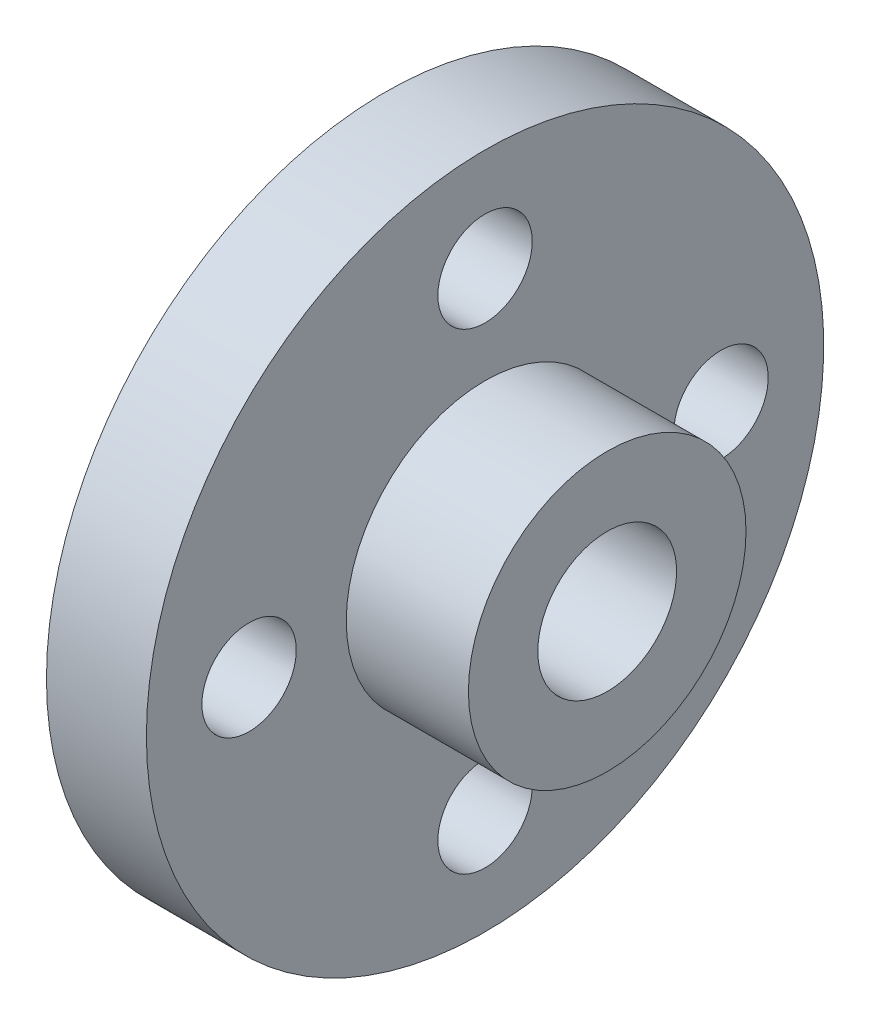
ISO-10303-21;
HEADER;
FILE_DESCRIPTION(('STEP AP214'),'2;1');
FILE_NAME('part.step','',(''),(''),'','','');
FILE_SCHEMA(('AUTOMOTIVE_DESIGN { 1 0 10303 214 1 1 1 1 }'));
ENDSEC;
DATA;
#1=APPLICATION_CONTEXT('core data for automotive mechanical design processes');
#2=APPLICATION_PROTOCOL_DEFINITION('international standard','automotive_design',2000,#1);
#3=PRODUCT_CONTEXT('',#1,'mechanical');
#4=PRODUCT('Part','Part','',(#3));
#5=PRODUCT_RELATED_PRODUCT_CATEGORY('part','',(#4));
#6=PRODUCT_DEFINITION_FORMATION('','',#4);
#7=PRODUCT_DEFINITION_CONTEXT('part definition',#1,'design');
#8=PRODUCT_DEFINITION('design','',#6,#7);
#9=PRODUCT_DEFINITION_SHAPE('','',#8);
#10=(LENGTH_UNIT() NAMED_UNIT(*) SI_UNIT(.MILLI.,.METRE.));
#11=(NAMED_UNIT(*) PLANE_ANGLE_UNIT() SI_UNIT($,.RADIAN.));
#12=(NAMED_UNIT(*) SI_UNIT($,.STERADIAN.) SOLID_ANGLE_UNIT());
#13=UNCERTAINTY_MEASURE_WITH_UNIT(LENGTH_MEASURE(1.E-05),#10,'distance_accuracy_value','');
#14=(GEOMETRIC_REPRESENTATION_CONTEXT(3) GLOBAL_UNCERTAINTY_ASSIGNED_CONTEXT((#13)) GLOBAL_UNIT_ASSIGNED_CONTEXT((#10,
#11,#12)) REPRESENTATION_CONTEXT('',''));
#15=CARTESIAN_POINT('',(0.,0.,0.));
#16=DIRECTION('',(0.,0.,1.));
#17=DIRECTION('',(1.,0.,0.));
#18=AXIS2_PLACEMENT_3D('',#15,#16,#17);
#19=CARTESIAN_POINT('',(-16.9594650205761,0.,0.));
#20=DIRECTION('',(-1.,0.,0.));
#21=DIRECTION('',(0.,0.,1.));
#22=AXIS2_PLACEMENT_3D('',#19,#20,#21);
#23=CYLINDRICAL_SURFACE('',#22,25.);
#24=CARTESIAN_POINT('',(0.,0.,0.));
#25=DIRECTION('',(-1.,0.,0.));
#26=DIRECTION('',(0.,0.,1.));
#27=AXIS2_PLACEMENT_3D('',#24,#25,#26);
#28=CIRCLE('',#27,25.);
#29=CARTESIAN_POINT('',(0.,0.,25.));
#30=VERTEX_POINT('',#29);
#31=EDGE_CURVE('E17',#30,#30,#28,.F.);
#32=ORIENTED_EDGE('',*,*,#31,.T.);
#33=EDGE_LOOP('',(#32));
#34=FACE_BOUND('',#33,.T.);
#35=CARTESIAN_POINT('',(22.,0.,0.));
#36=DIRECTION('',(-1.,0.,0.));
#37=DIRECTION('',(0.,0.,1.));
#38=AXIS2_PLACEMENT_3D('',#35,#36,#37);
#39=CIRCLE('',#38,25.);
#40=CARTESIAN_POINT('',(22.,0.,25.));
#41=VERTEX_POINT('',#40);
#42=EDGE_CURVE('E57',#41,#41,#39,.T.);
#43=ORIENTED_EDGE('',*,*,#42,.T.);
#44=EDGE_LOOP('',(#43));
#45=FACE_BOUND('',#44,.T.);
#46=ADVANCED_FACE('F14',(#34,#45),#23,.T.);
#47=CARTESIAN_POINT('',(0.,61.,0.));
#48=DIRECTION('',(-1.,0.,0.));
#49=DIRECTION('',(0.,0.,1.));
#50=AXIS2_PLACEMENT_3D('',#47,#48,#49);
#51=PLANE('',#50);
#52=CARTESIAN_POINT('',(0.,4.451638707025E-13,-42.5));
#53=DIRECTION('',(-1.,0.,0.));
#54=DIRECTION('',(0.,0.,1.));
#55=AXIS2_PLACEMENT_3D('',#52,#53,#54);
#56=CIRCLE('',#55,8.5);
#57=CARTESIAN_POINT('',(0.,4.451638707025E-13,-34.));
#58=VERTEX_POINT('',#57);
#59=EDGE_CURVE('E55',#58,#58,#56,.T.);
#60=ORIENTED_EDGE('',*,*,#59,.T.);
#61=EDGE_LOOP('',(#60));
#62=FACE_BOUND('',#61,.T.);
#63=CARTESIAN_POINT('',(0.,-1.48387956900833E-13,42.5));
#64=DIRECTION('',(-1.,0.,0.));
#65=DIRECTION('',(0.,0.,1.));
#66=AXIS2_PLACEMENT_3D('',#63,#64,#65);
#67=CIRCLE('',#66,8.5);
#68=CARTESIAN_POINT('',(0.,-1.48387956900833E-13,51.));
#69=VERTEX_POINT('',#68);
#70=EDGE_CURVE('E52',#69,#69,#67,.T.);
#71=ORIENTED_EDGE('',*,*,#70,.T.);
#72=EDGE_LOOP('',(#71));
#73=FACE_BOUND('',#72,.T.);
#74=ORIENTED_EDGE('',*,*,#31,.F.);
#75=EDGE_LOOP('',(#74));
#76=FACE_BOUND('',#75,.T.);
#77=CARTESIAN_POINT('',(0.,0.,0.));
#78=DIRECTION('',(-1.,0.,0.));
#79=DIRECTION('',(0.,0.,1.));
#80=AXIS2_PLACEMENT_3D('',#77,#78,#79);
#81=CIRCLE('',#80,61.);
#82=CARTESIAN_POINT('',(0.,0.,61.));
#83=VERTEX_POINT('',#82);
#84=EDGE_CURVE('E49',#83,#83,#81,.T.);
#85=ORIENTED_EDGE('',*,*,#84,.F.);
#86=EDGE_LOOP('',(#85));
#87=FACE_BOUND('',#86,.T.);
#88=CARTESIAN_POINT('',(0.,42.5,0.));
#89=DIRECTION('',(-1.,0.,0.));
#90=DIRECTION('',(0.,0.,1.));
#91=AXIS2_PLACEMENT_3D('',#88,#89,#90);
#92=CIRCLE('',#91,8.5);
#93=CARTESIAN_POINT('',(0.,42.5,8.5));
#94=VERTEX_POINT('',#93);
#95=EDGE_CURVE('E46',#94,#94,#92,.T.);
#96=ORIENTED_EDGE('',*,*,#95,.T.);
#97=EDGE_LOOP('',(#96));
#98=FACE_BOUND('',#97,.T.);
#99=CARTESIAN_POINT('',(0.,-42.5,-2.96775913801666E-13));
#100=DIRECTION('',(-1.,0.,0.));
#101=DIRECTION('',(0.,0.,1.));
#102=AXIS2_PLACEMENT_3D('',#99,#100,#101);
#103=CIRCLE('',#102,8.5);
#104=CARTESIAN_POINT('',(0.,-42.5,8.4999999999997));
#105=VERTEX_POINT('',#104);
#106=EDGE_CURVE('E43',#105,#105,#103,.T.);
#107=ORIENTED_EDGE('',*,*,#106,.T.);
#108=EDGE_LOOP('',(#107));
#109=FACE_BOUND('',#108,.T.);
#110=ADVANCED_FACE('F65',(#62,#73,#76,#87,#98,#109),#51,.F.);
#111=CARTESIAN_POINT('',(22.,25.,0.));
#112=DIRECTION('',(-1.,0.,0.));
#113=DIRECTION('',(0.,0.,1.));
#114=AXIS2_PLACEMENT_3D('',#111,#112,#113);
#115=PLANE('',#114);
#116=CARTESIAN_POINT('',(22.,0.,0.));
#117=DIRECTION('',(-1.,0.,0.));
#118=DIRECTION('',(0.,0.,1.));
#119=AXIS2_PLACEMENT_3D('',#116,#117,#118);
#120=CIRCLE('',#119,12.5);
#121=CARTESIAN_POINT('',(22.,0.,12.5));
#122=VERTEX_POINT('',#121);
#123=EDGE_CURVE('E40',#122,#122,#120,.T.);
#124=ORIENTED_EDGE('',*,*,#123,.T.);
#125=EDGE_LOOP('',(#124));
#126=FACE_BOUND('',#125,.T.);
#127=ORIENTED_EDGE('',*,*,#42,.F.);
#128=EDGE_LOOP('',(#127));
#129=FACE_BOUND('',#128,.T.);
#130=ADVANCED_FACE('F68',(#126,#129),#115,.F.);
#131=CARTESIAN_POINT('',(22.,4.451638707025E-13,-42.5));
#132=DIRECTION('',(-1.,0.,0.));
#133=DIRECTION('',(0.,0.,1.));
#134=AXIS2_PLACEMENT_3D('',#131,#132,#133);
#135=CYLINDRICAL_SURFACE('',#134,8.5);
#136=CARTESIAN_POINT('',(-18.,4.451638707025E-13,-42.5));
#137=DIRECTION('',(-1.,0.,0.));
#138=DIRECTION('',(0.,0.,1.));
#139=AXIS2_PLACEMENT_3D('',#136,#137,#138);
#140=CIRCLE('',#139,8.5);
#141=CARTESIAN_POINT('',(-18.,4.451638707025E-13,-34.));
#142=VERTEX_POINT('',#141);
#143=EDGE_CURVE('E37',#142,#142,#140,.T.);
#144=ORIENTED_EDGE('',*,*,#143,.T.);
#145=EDGE_LOOP('',(#144));
#146=FACE_BOUND('',#145,.T.);
#147=ORIENTED_EDGE('',*,*,#59,.F.);
#148=EDGE_LOOP('',(#147));
#149=FACE_BOUND('',#148,.T.);
#150=ADVANCED_FACE('F109',(#146,#149),#135,.F.);
#151=CARTESIAN_POINT('',(22.,-1.48387956900833E-13,42.5));
#152=DIRECTION('',(-1.,0.,0.));
#153=DIRECTION('',(0.,0.,1.));
#154=AXIS2_PLACEMENT_3D('',#151,#152,#153);
#155=CYLINDRICAL_SURFACE('',#154,8.5);
#156=CARTESIAN_POINT('',(-18.,-1.48387956900833E-13,42.5));
#157=DIRECTION('',(-1.,0.,0.));
#158=DIRECTION('',(0.,0.,1.));
#159=AXIS2_PLACEMENT_3D('',#156,#157,#158);
#160=CIRCLE('',#159,8.5);
#161=CARTESIAN_POINT('',(-18.,-1.48387956900833E-13,51.));
#162=VERTEX_POINT('',#161);
#163=EDGE_CURVE('E34',#162,#162,#160,.T.);
#164=ORIENTED_EDGE('',*,*,#163,.T.);
#165=EDGE_LOOP('',(#164));
#166=FACE_BOUND('',#165,.T.);
#167=ORIENTED_EDGE('',*,*,#70,.F.);
#168=EDGE_LOOP('',(#167));
#169=FACE_BOUND('',#168,.T.);
#170=ADVANCED_FACE('F112',(#166,#169),#155,.F.);
#171=CARTESIAN_POINT('',(-16.9594650205761,0.,0.));
#172=DIRECTION('',(-1.,0.,0.));
#173=DIRECTION('',(0.,0.,1.));
#174=AXIS2_PLACEMENT_3D('',#171,#172,#173);
#175=CYLINDRICAL_SURFACE('',#174,61.);
#176=CARTESIAN_POINT('',(-18.,0.,0.));
#177=DIRECTION('',(-1.,0.,0.));
#178=DIRECTION('',(0.,0.,1.));
#179=AXIS2_PLACEMENT_3D('',#176,#177,#178);
#180=CIRCLE('',#179,61.);
#181=CARTESIAN_POINT('',(-18.,0.,61.));
#182=VERTEX_POINT('',#181);
#183=EDGE_CURVE('E31',#182,#182,#180,.F.);
#184=ORIENTED_EDGE('',*,*,#183,.T.);
#185=EDGE_LOOP('',(#184));
#186=FACE_BOUND('',#185,.T.);
#187=ORIENTED_EDGE('',*,*,#84,.T.);
#188=EDGE_LOOP('',(#187));
#189=FACE_BOUND('',#188,.T.);
#190=ADVANCED_FACE('F90',(#186,#189),#175,.T.);
#191=CARTESIAN_POINT('',(22.,42.5,0.));
#192=DIRECTION('',(-1.,0.,0.));
#193=DIRECTION('',(0.,0.,1.));
#194=AXIS2_PLACEMENT_3D('',#191,#192,#193);
#195=CYLINDRICAL_SURFACE('',#194,8.5);
#196=CARTESIAN_POINT('',(-18.,42.5,0.));
#197=DIRECTION('',(-1.,0.,0.));
#198=DIRECTION('',(0.,0.,1.));
#199=AXIS2_PLACEMENT_3D('',#196,#197,#198);
#200=CIRCLE('',#199,8.5);
#201=CARTESIAN_POINT('',(-18.,42.5,8.5));
#202=VERTEX_POINT('',#201);
#203=EDGE_CURVE('E26',#202,#202,#200,.T.);
#204=ORIENTED_EDGE('',*,*,#203,.T.);
#205=EDGE_LOOP('',(#204));
#206=FACE_BOUND('',#205,.T.);
#207=ORIENTED_EDGE('',*,*,#95,.F.);
#208=EDGE_LOOP('',(#207));
#209=FACE_BOUND('',#208,.T.);
#210=ADVANCED_FACE('F79',(#206,#209),#195,.F.);
#211=CARTESIAN_POINT('',(22.,-42.5,-2.96775913801666E-13));
#212=DIRECTION('',(-1.,0.,0.));
#213=DIRECTION('',(0.,0.,1.));
#214=AXIS2_PLACEMENT_3D('',#211,#212,#213);
#215=CYLINDRICAL_SURFACE('',#214,8.5);
#216=CARTESIAN_POINT('',(-18.,-42.5,-2.96775913801666E-13));
#217=DIRECTION('',(-1.,0.,0.));
#218=DIRECTION('',(0.,0.,1.));
#219=AXIS2_PLACEMENT_3D('',#216,#217,#218);
#220=CIRCLE('',#219,8.5);
#221=CARTESIAN_POINT('',(-18.,-42.5,8.4999999999997));
#222=VERTEX_POINT('',#221);
#223=EDGE_CURVE('E21',#222,#222,#220,.T.);
#224=ORIENTED_EDGE('',*,*,#223,.T.);
#225=EDGE_LOOP('',(#224));
#226=FACE_BOUND('',#225,.T.);
#227=ORIENTED_EDGE('',*,*,#106,.F.);
#228=EDGE_LOOP('',(#227));
#229=FACE_BOUND('',#228,.T.);
#230=ADVANCED_FACE('F76',(#226,#229),#215,.F.);
#231=CARTESIAN_POINT('',(-9.48503389009925,0.,0.));
#232=DIRECTION('',(-1.,0.,0.));
#233=DIRECTION('',(0.,0.,1.));
#234=AXIS2_PLACEMENT_3D('',#231,#232,#233);
#235=CYLINDRICAL_SURFACE('',#234,12.5);
#236=ORIENTED_EDGE('',*,*,#123,.F.);
#237=EDGE_LOOP('',(#236));
#238=FACE_BOUND('',#237,.T.);
#239=CARTESIAN_POINT('',(-18.,0.,0.));
#240=DIRECTION('',(-1.,0.,0.));
#241=DIRECTION('',(0.,0.,1.));
#242=AXIS2_PLACEMENT_3D('',#239,#240,#241);
#243=CIRCLE('',#242,12.5);
#244=CARTESIAN_POINT('',(-18.,0.,12.5));
#245=VERTEX_POINT('',#244);
#246=EDGE_CURVE('E10',#245,#245,#243,.T.);
#247=ORIENTED_EDGE('',*,*,#246,.T.);
#248=EDGE_LOOP('',(#247));
#249=FACE_BOUND('',#248,.T.);
#250=ADVANCED_FACE('F78',(#238,#249),#235,.F.);
#251=CARTESIAN_POINT('',(-18.,0.,0.));
#252=DIRECTION('',(1.,0.,0.));
#253=DIRECTION('',(0.,0.,-1.));
#254=AXIS2_PLACEMENT_3D('',#251,#252,#253);
#255=PLANE('',#254);
#256=ORIENTED_EDGE('',*,*,#246,.F.);
#257=EDGE_LOOP('',(#256));
#258=FACE_BOUND('',#257,.T.);
#259=ORIENTED_EDGE('',*,*,#223,.F.);
#260=EDGE_LOOP('',(#259));
#261=FACE_BOUND('',#260,.T.);
#262=ORIENTED_EDGE('',*,*,#203,.F.);
#263=EDGE_LOOP('',(#262));
#264=FACE_BOUND('',#263,.T.);
#265=ORIENTED_EDGE('',*,*,#183,.F.);
#266=EDGE_LOOP('',(#265));
#267=FACE_BOUND('',#266,.T.);
#268=ORIENTED_EDGE('',*,*,#163,.F.);
#269=EDGE_LOOP('',(#268));
#270=FACE_BOUND('',#269,.T.);
#271=ORIENTED_EDGE('',*,*,#143,.F.);
#272=EDGE_LOOP('',(#271));
#273=FACE_BOUND('',#272,.T.);
#274=ADVANCED_FACE('F87',(#258,#261,#264,#267,#270,#273),#255,.F.);
#275=CLOSED_SHELL('',(#46,#110,#130,#150,#170,#190,#210,#230,#250,#274));
#276=MANIFOLD_SOLID_BREP('B1',#275);
#277=ADVANCED_BREP_SHAPE_REPRESENTATION('',(#18,#276),#14);
#278=SHAPE_DEFINITION_REPRESENTATION(#9,#277);
ENDSEC;
END-ISO-10303-21;
